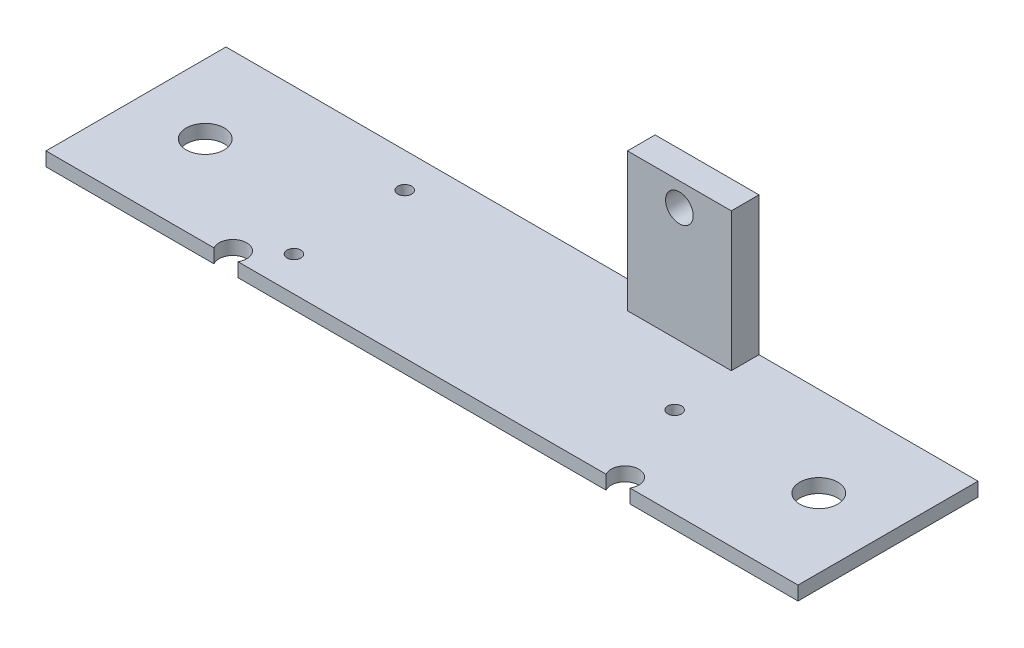
ISO-10303-21;
HEADER;
FILE_DESCRIPTION(('STEP AP214'),'2;1');
FILE_NAME('part.step','',(''),(''),'','','');
FILE_SCHEMA(('AUTOMOTIVE_DESIGN { 1 0 10303 214 1 1 1 1 }'));
ENDSEC;
DATA;
#1=APPLICATION_CONTEXT('core data for automotive mechanical design processes');
#2=APPLICATION_PROTOCOL_DEFINITION('international standard','automotive_design',2000,#1);
#3=PRODUCT_CONTEXT('',#1,'mechanical');
#4=PRODUCT('Part','Part','',(#3));
#5=PRODUCT_RELATED_PRODUCT_CATEGORY('part','',(#4));
#6=PRODUCT_DEFINITION_FORMATION('','',#4);
#7=PRODUCT_DEFINITION_CONTEXT('part definition',#1,'design');
#8=PRODUCT_DEFINITION('design','',#6,#7);
#9=PRODUCT_DEFINITION_SHAPE('','',#8);
#10=(LENGTH_UNIT() NAMED_UNIT(*) SI_UNIT(.MILLI.,.METRE.));
#11=(NAMED_UNIT(*) PLANE_ANGLE_UNIT() SI_UNIT($,.RADIAN.));
#12=(NAMED_UNIT(*) SI_UNIT($,.STERADIAN.) SOLID_ANGLE_UNIT());
#13=UNCERTAINTY_MEASURE_WITH_UNIT(LENGTH_MEASURE(1.E-05),#10,'distance_accuracy_value','');
#14=(GEOMETRIC_REPRESENTATION_CONTEXT(3) GLOBAL_UNCERTAINTY_ASSIGNED_CONTEXT((#13)) GLOBAL_UNIT_ASSIGNED_CONTEXT((#10,
#11,#12)) REPRESENTATION_CONTEXT('',''));
#15=CARTESIAN_POINT('',(0.,0.,0.));
#16=DIRECTION('',(0.,0.,1.));
#17=DIRECTION('',(1.,0.,0.));
#18=AXIS2_PLACEMENT_3D('',#15,#16,#17);
#19=CARTESIAN_POINT('',(-82.64,2.,25.));
#20=DIRECTION('',(0.,-1.,0.));
#21=DIRECTION('',(0.,0.,-1.));
#22=AXIS2_PLACEMENT_3D('',#19,#20,#21);
#23=CYLINDRICAL_SURFACE('',#22,2.);
#24=CARTESIAN_POINT('',(-82.64,0.,25.));
#25=DIRECTION('',(0.,1.,0.));
#26=DIRECTION('',(0.,0.,1.));
#27=AXIS2_PLACEMENT_3D('',#24,#25,#26);
#28=CIRCLE('',#27,2.);
#29=CARTESIAN_POINT('',(-80.9079491924311,0.,26.));
#30=VERTEX_POINT('',#29);
#31=CARTESIAN_POINT('',(-84.3720508075689,0.,26.));
#32=VERTEX_POINT('',#31);
#33=EDGE_CURVE('E202',#30,#32,#28,.T.);
#34=ORIENTED_EDGE('',*,*,#33,.F.);
#35=DIRECTION('',(0.,-1.,0.));
#36=VECTOR('',#35,1.);
#37=CARTESIAN_POINT('',(-80.9079491924311,2.,26.));
#38=LINE('',#37,#36);
#39=CARTESIAN_POINT('',(-80.9079491924311,2.,26.));
#40=VERTEX_POINT('',#39);
#41=EDGE_CURVE('E11',#40,#30,#38,.T.);
#42=ORIENTED_EDGE('',*,*,#41,.F.);
#43=CARTESIAN_POINT('',(-82.64,2.,25.));
#44=DIRECTION('',(0.,1.,0.));
#45=DIRECTION('',(0.,0.,1.));
#46=AXIS2_PLACEMENT_3D('',#43,#44,#45);
#47=CIRCLE('',#46,2.);
#48=CARTESIAN_POINT('',(-84.3720508075689,2.,26.));
#49=VERTEX_POINT('',#48);
#50=EDGE_CURVE('E171',#40,#49,#47,.T.);
#51=ORIENTED_EDGE('',*,*,#50,.T.);
#52=DIRECTION('',(0.,-1.,0.));
#53=VECTOR('',#52,1.);
#54=CARTESIAN_POINT('',(-84.3720508075689,2.,26.));
#55=LINE('',#54,#53);
#56=EDGE_CURVE('E195',#49,#32,#55,.T.);
#57=ORIENTED_EDGE('',*,*,#56,.T.);
#58=EDGE_LOOP('',(#34,#42,#51,#57));
#59=FACE_BOUND('',#58,.T.);
#60=ADVANCED_FACE('F41',(#59),#23,.F.);
#61=CARTESIAN_POINT('',(0.,2.,26.));
#62=DIRECTION('',(0.,0.,1.));
#63=DIRECTION('',(1.,0.,0.));
#64=AXIS2_PLACEMENT_3D('',#61,#62,#63);
#65=PLANE('',#64);
#66=DIRECTION('',(-1.,0.,0.));
#67=VECTOR('',#66,1.);
#68=CARTESIAN_POINT('',(0.,0.,26.));
#69=LINE('',#68,#67);
#70=CARTESIAN_POINT('',(-27.7320508075689,0.,26.));
#71=VERTEX_POINT('',#70);
#72=EDGE_CURVE('E205',#71,#30,#69,.T.);
#73=ORIENTED_EDGE('',*,*,#72,.F.);
#74=DIRECTION('',(0.,-1.,0.));
#75=VECTOR('',#74,1.);
#76=CARTESIAN_POINT('',(-27.7320508075689,2.,26.));
#77=LINE('',#76,#75);
#78=CARTESIAN_POINT('',(-27.7320508075689,2.,26.));
#79=VERTEX_POINT('',#78);
#80=EDGE_CURVE('E49',#79,#71,#77,.T.);
#81=ORIENTED_EDGE('',*,*,#80,.F.);
#82=DIRECTION('',(-1.,0.,0.));
#83=VECTOR('',#82,1.);
#84=CARTESIAN_POINT('',(0.,2.,26.));
#85=LINE('',#84,#83);
#86=EDGE_CURVE('E174',#79,#40,#85,.T.);
#87=ORIENTED_EDGE('',*,*,#86,.T.);
#88=ORIENTED_EDGE('',*,*,#41,.T.);
#89=EDGE_LOOP('',(#73,#81,#87,#88));
#90=FACE_BOUND('',#89,.T.);
#91=ADVANCED_FACE('F245',(#90),#65,.T.);
#92=CARTESIAN_POINT('',(-26.,2.,25.));
#93=DIRECTION('',(0.,-1.,0.));
#94=DIRECTION('',(0.,0.,-1.));
#95=AXIS2_PLACEMENT_3D('',#92,#93,#94);
#96=CYLINDRICAL_SURFACE('',#95,2.);
#97=CARTESIAN_POINT('',(-26.,0.,25.));
#98=DIRECTION('',(0.,1.,0.));
#99=DIRECTION('',(0.,0.,1.));
#100=AXIS2_PLACEMENT_3D('',#97,#98,#99);
#101=CIRCLE('',#100,2.);
#102=CARTESIAN_POINT('',(-24.2679491924311,0.,26.));
#103=VERTEX_POINT('',#102);
#104=EDGE_CURVE('E208',#103,#71,#101,.T.);
#105=ORIENTED_EDGE('',*,*,#104,.F.);
#106=DIRECTION('',(0.,-1.,0.));
#107=VECTOR('',#106,1.);
#108=CARTESIAN_POINT('',(-24.2679491924311,2.,26.));
#109=LINE('',#108,#107);
#110=CARTESIAN_POINT('',(-24.2679491924311,2.,26.));
#111=VERTEX_POINT('',#110);
#112=EDGE_CURVE('E236',#111,#103,#109,.T.);
#113=ORIENTED_EDGE('',*,*,#112,.F.);
#114=CARTESIAN_POINT('',(-26.,2.,25.));
#115=DIRECTION('',(0.,1.,0.));
#116=DIRECTION('',(0.,0.,1.));
#117=AXIS2_PLACEMENT_3D('',#114,#115,#116);
#118=CIRCLE('',#117,2.);
#119=EDGE_CURVE('E177',#111,#79,#118,.T.);
#120=ORIENTED_EDGE('',*,*,#119,.T.);
#121=ORIENTED_EDGE('',*,*,#80,.T.);
#122=EDGE_LOOP('',(#105,#113,#120,#121));
#123=FACE_BOUND('',#122,.T.);
#124=ADVANCED_FACE('F240',(#123),#96,.F.);
#125=CARTESIAN_POINT('',(0.,0.,26.));
#126=VERTEX_POINT('',#125);
#127=EDGE_CURVE('E210',#126,#103,#69,.T.);
#128=ORIENTED_EDGE('',*,*,#127,.F.);
#129=DIRECTION('',(0.,-1.,0.));
#130=VECTOR('',#129,1.);
#131=CARTESIAN_POINT('',(0.,2.,26.));
#132=LINE('',#131,#130);
#133=CARTESIAN_POINT('',(0.,2.,26.));
#134=VERTEX_POINT('',#133);
#135=EDGE_CURVE('E234',#134,#126,#132,.T.);
#136=ORIENTED_EDGE('',*,*,#135,.F.);
#137=EDGE_CURVE('E179',#134,#111,#85,.T.);
#138=ORIENTED_EDGE('',*,*,#137,.T.);
#139=ORIENTED_EDGE('',*,*,#112,.T.);
#140=EDGE_LOOP('',(#128,#136,#138,#139));
#141=FACE_BOUND('',#140,.T.);
#142=ADVANCED_FACE('F270',(#141),#65,.T.);
#143=CARTESIAN_POINT('',(0.,2.,0.));
#144=DIRECTION('',(1.,0.,0.));
#145=DIRECTION('',(0.,0.,-1.));
#146=AXIS2_PLACEMENT_3D('',#143,#144,#145);
#147=PLANE('',#146);
#148=DIRECTION('',(0.,0.,1.));
#149=VECTOR('',#148,1.);
#150=CARTESIAN_POINT('',(0.,0.,0.));
#151=LINE('',#150,#149);
#152=CARTESIAN_POINT('',(0.,0.,0.));
#153=VERTEX_POINT('',#152);
#154=EDGE_CURVE('E213',#153,#126,#151,.T.);
#155=ORIENTED_EDGE('',*,*,#154,.F.);
#156=DIRECTION('',(0.,-1.,0.));
#157=VECTOR('',#156,1.);
#158=CARTESIAN_POINT('',(0.,2.,0.));
#159=LINE('',#158,#157);
#160=CARTESIAN_POINT('',(0.,2.,0.));
#161=VERTEX_POINT('',#160);
#162=EDGE_CURVE('E232',#161,#153,#159,.T.);
#163=ORIENTED_EDGE('',*,*,#162,.F.);
#164=DIRECTION('',(0.,0.,1.));
#165=VECTOR('',#164,1.);
#166=CARTESIAN_POINT('',(0.,2.,0.));
#167=LINE('',#166,#165);
#168=EDGE_CURVE('E182',#161,#134,#167,.T.);
#169=ORIENTED_EDGE('',*,*,#168,.T.);
#170=ORIENTED_EDGE('',*,*,#135,.T.);
#171=EDGE_LOOP('',(#155,#163,#169,#170));
#172=FACE_BOUND('',#171,.T.);
#173=ADVANCED_FACE('F266',(#172),#147,.T.);
#174=CARTESIAN_POINT('',(0.,2.,0.));
#175=DIRECTION('',(0.,0.,1.));
#176=DIRECTION('',(1.,0.,0.));
#177=AXIS2_PLACEMENT_3D('',#174,#175,#176);
#178=PLANE('',#177);
#179=CARTESIAN_POINT('',(-39.1383641892585,18.6227285915926,0.));
#180=DIRECTION('',(0.,0.,1.));
#181=DIRECTION('',(1.,0.,0.));
#182=AXIS2_PLACEMENT_3D('',#179,#180,#181);
#183=CIRCLE('',#182,2.);
#184=CARTESIAN_POINT('',(-37.1383641892585,18.6227285915926,0.));
#185=VERTEX_POINT('',#184);
#186=EDGE_CURVE('E461',#185,#185,#183,.T.);
#187=ORIENTED_EDGE('',*,*,#186,.T.);
#188=EDGE_LOOP('',(#187));
#189=FACE_BOUND('',#188,.T.);
#190=DIRECTION('',(-1.,0.,0.));
#191=VECTOR('',#190,1.);
#192=CARTESIAN_POINT('',(0.,0.,0.));
#193=LINE('',#192,#191);
#194=CARTESIAN_POINT('',(-108.64,0.,0.));
#195=VERTEX_POINT('',#194);
#196=EDGE_CURVE('E216',#153,#195,#193,.T.);
#197=ORIENTED_EDGE('',*,*,#196,.T.);
#198=DIRECTION('',(0.,-1.,0.));
#199=VECTOR('',#198,1.);
#200=CARTESIAN_POINT('',(-108.64,2.,0.));
#201=LINE('',#200,#199);
#202=CARTESIAN_POINT('',(-108.64,2.,0.));
#203=VERTEX_POINT('',#202);
#204=EDGE_CURVE('E229',#203,#195,#201,.T.);
#205=ORIENTED_EDGE('',*,*,#204,.F.);
#206=DIRECTION('',(-1.,0.,0.));
#207=VECTOR('',#206,1.);
#208=CARTESIAN_POINT('',(0.,2.,0.));
#209=LINE('',#208,#207);
#210=CARTESIAN_POINT('',(-46.6383641892585,2.,0.));
#211=VERTEX_POINT('',#210);
#212=EDGE_CURVE('E185',#211,#203,#209,.T.);
#213=ORIENTED_EDGE('',*,*,#212,.F.);
#214=DIRECTION('',(0.,-1.,0.));
#215=VECTOR('',#214,1.);
#216=CARTESIAN_POINT('',(-46.6383641892585,22.,0.));
#217=LINE('',#216,#215);
#218=CARTESIAN_POINT('',(-46.6383641892585,22.,0.));
#219=VERTEX_POINT('',#218);
#220=EDGE_CURVE('E136',#219,#211,#217,.T.);
#221=ORIENTED_EDGE('',*,*,#220,.F.);
#222=DIRECTION('',(-1.,0.,0.));
#223=VECTOR('',#222,1.);
#224=CARTESIAN_POINT('',(-31.6383641892585,22.,0.));
#225=LINE('',#224,#223);
#226=CARTESIAN_POINT('',(-31.6383641892585,22.,0.));
#227=VERTEX_POINT('',#226);
#228=EDGE_CURVE('E128',#227,#219,#225,.T.);
#229=ORIENTED_EDGE('',*,*,#228,.F.);
#230=DIRECTION('',(0.,-1.,0.));
#231=VECTOR('',#230,1.);
#232=CARTESIAN_POINT('',(-31.6383641892585,22.,0.));
#233=LINE('',#232,#231);
#234=CARTESIAN_POINT('',(-31.6383641892585,2.,0.));
#235=VERTEX_POINT('',#234);
#236=EDGE_CURVE('E134',#227,#235,#233,.T.);
#237=ORIENTED_EDGE('',*,*,#236,.T.);
#238=EDGE_CURVE('E186',#161,#235,#209,.T.);
#239=ORIENTED_EDGE('',*,*,#238,.F.);
#240=ORIENTED_EDGE('',*,*,#162,.T.);
#241=EDGE_LOOP('',(#197,#205,#213,#221,#229,#237,#239,#240));
#242=FACE_BOUND('',#241,.T.);
#243=ADVANCED_FACE('F131',(#189,#242),#178,.F.);
#244=CARTESIAN_POINT('',(-108.64,2.,0.));
#245=DIRECTION('',(1.,0.,0.));
#246=DIRECTION('',(0.,0.,-1.));
#247=AXIS2_PLACEMENT_3D('',#244,#245,#246);
#248=PLANE('',#247);
#249=DIRECTION('',(0.,0.,1.));
#250=VECTOR('',#249,1.);
#251=CARTESIAN_POINT('',(-108.64,0.,0.));
#252=LINE('',#251,#250);
#253=CARTESIAN_POINT('',(-108.64,0.,26.));
#254=VERTEX_POINT('',#253);
#255=EDGE_CURVE('E218',#195,#254,#252,.T.);
#256=ORIENTED_EDGE('',*,*,#255,.T.);
#257=DIRECTION('',(0.,-1.,0.));
#258=VECTOR('',#257,1.);
#259=CARTESIAN_POINT('',(-108.64,2.,26.));
#260=LINE('',#259,#258);
#261=CARTESIAN_POINT('',(-108.64,2.,26.));
#262=VERTEX_POINT('',#261);
#263=EDGE_CURVE('E227',#262,#254,#260,.T.);
#264=ORIENTED_EDGE('',*,*,#263,.F.);
#265=DIRECTION('',(0.,0.,1.));
#266=VECTOR('',#265,1.);
#267=CARTESIAN_POINT('',(-108.64,2.,0.));
#268=LINE('',#267,#266);
#269=EDGE_CURVE('E188',#203,#262,#268,.T.);
#270=ORIENTED_EDGE('',*,*,#269,.F.);
#271=ORIENTED_EDGE('',*,*,#204,.T.);
#272=EDGE_LOOP('',(#256,#264,#270,#271));
#273=FACE_BOUND('',#272,.T.);
#274=ADVANCED_FACE('F263',(#273),#248,.F.);
#275=CARTESIAN_POINT('',(-10.,2.,13.));
#276=DIRECTION('',(0.,-1.,0.));
#277=DIRECTION('',(0.,0.,-1.));
#278=AXIS2_PLACEMENT_3D('',#275,#276,#277);
#279=CYLINDRICAL_SURFACE('',#278,2.75);
#280=CARTESIAN_POINT('',(-10.,2.,13.));
#281=DIRECTION('',(0.,1.,0.));
#282=DIRECTION('',(0.,0.,1.));
#283=AXIS2_PLACEMENT_3D('',#280,#281,#282);
#284=CIRCLE('',#283,2.75);
#285=CARTESIAN_POINT('',(-10.,2.,15.75));
#286=VERTEX_POINT('',#285);
#287=EDGE_CURVE('E190',#286,#286,#284,.T.);
#288=ORIENTED_EDGE('',*,*,#287,.T.);
#289=EDGE_LOOP('',(#288));
#290=FACE_BOUND('',#289,.T.);
#291=CARTESIAN_POINT('',(-10.,0.,13.));
#292=DIRECTION('',(0.,1.,0.));
#293=DIRECTION('',(0.,0.,1.));
#294=AXIS2_PLACEMENT_3D('',#291,#292,#293);
#295=CIRCLE('',#294,2.75);
#296=CARTESIAN_POINT('',(-10.,0.,15.75));
#297=VERTEX_POINT('',#296);
#298=EDGE_CURVE('E221',#297,#297,#295,.T.);
#299=ORIENTED_EDGE('',*,*,#298,.F.);
#300=EDGE_LOOP('',(#299));
#301=FACE_BOUND('',#300,.T.);
#302=ADVANCED_FACE('F316',(#290,#301),#279,.F.);
#303=EDGE_CURVE('E209',#32,#254,#69,.T.);
#304=ORIENTED_EDGE('',*,*,#303,.F.);
#305=ORIENTED_EDGE('',*,*,#56,.F.);
#306=EDGE_CURVE('E178',#49,#262,#85,.T.);
#307=ORIENTED_EDGE('',*,*,#306,.T.);
#308=ORIENTED_EDGE('',*,*,#263,.T.);
#309=EDGE_LOOP('',(#304,#305,#307,#308));
#310=FACE_BOUND('',#309,.T.);
#311=ADVANCED_FACE('F257',(#310),#65,.T.);
#312=CARTESIAN_POINT('',(-30.82,2.,13.));
#313=DIRECTION('',(0.,-1.,0.));
#314=DIRECTION('',(0.,0.,-1.));
#315=AXIS2_PLACEMENT_3D('',#312,#313,#314);
#316=CYLINDRICAL_SURFACE('',#315,1.);
#317=CARTESIAN_POINT('',(-30.82,2.,13.));
#318=DIRECTION('',(0.,1.,0.));
#319=DIRECTION('',(0.,0.,1.));
#320=AXIS2_PLACEMENT_3D('',#317,#318,#319);
#321=CIRCLE('',#320,1.);
#322=CARTESIAN_POINT('',(-30.82,2.,14.));
#323=VERTEX_POINT('',#322);
#324=EDGE_CURVE('E168',#323,#323,#321,.T.);
#325=ORIENTED_EDGE('',*,*,#324,.T.);
#326=EDGE_LOOP('',(#325));
#327=FACE_BOUND('',#326,.T.);
#328=CARTESIAN_POINT('',(-30.82,0.,13.));
#329=DIRECTION('',(0.,1.,0.));
#330=DIRECTION('',(0.,0.,1.));
#331=AXIS2_PLACEMENT_3D('',#328,#329,#330);
#332=CIRCLE('',#331,1.);
#333=CARTESIAN_POINT('',(-30.82,0.,14.));
#334=VERTEX_POINT('',#333);
#335=EDGE_CURVE('E199',#334,#334,#332,.T.);
#336=ORIENTED_EDGE('',*,*,#335,.F.);
#337=EDGE_LOOP('',(#336));
#338=FACE_BOUND('',#337,.T.);
#339=ADVANCED_FACE('F284',(#327,#338),#316,.F.);
#340=CARTESIAN_POINT('',(-77.82,2.,21.));
#341=DIRECTION('',(0.,-1.,0.));
#342=DIRECTION('',(0.,0.,-1.));
#343=AXIS2_PLACEMENT_3D('',#340,#341,#342);
#344=CYLINDRICAL_SURFACE('',#343,0.999999999999998);
#345=CARTESIAN_POINT('',(-77.82,2.,21.));
#346=DIRECTION('',(0.,1.,0.));
#347=DIRECTION('',(0.,0.,1.));
#348=AXIS2_PLACEMENT_3D('',#345,#346,#347);
#349=CIRCLE('',#348,0.999999999999998);
#350=CARTESIAN_POINT('',(-77.82,2.,22.));
#351=VERTEX_POINT('',#350);
#352=EDGE_CURVE('E164',#351,#351,#349,.T.);
#353=ORIENTED_EDGE('',*,*,#352,.T.);
#354=EDGE_LOOP('',(#353));
#355=FACE_BOUND('',#354,.T.);
#356=CARTESIAN_POINT('',(-77.82,0.,21.));
#357=DIRECTION('',(0.,1.,0.));
#358=DIRECTION('',(0.,0.,1.));
#359=AXIS2_PLACEMENT_3D('',#356,#357,#358);
#360=CIRCLE('',#359,0.999999999999998);
#361=CARTESIAN_POINT('',(-77.82,0.,22.));
#362=VERTEX_POINT('',#361);
#363=EDGE_CURVE('E155',#362,#362,#360,.T.);
#364=ORIENTED_EDGE('',*,*,#363,.F.);
#365=EDGE_LOOP('',(#364));
#366=FACE_BOUND('',#365,.T.);
#367=ADVANCED_FACE('F286',(#355,#366),#344,.F.);
#368=CARTESIAN_POINT('',(-77.82,2.,5.));
#369=DIRECTION('',(0.,-1.,0.));
#370=DIRECTION('',(0.,0.,-1.));
#371=AXIS2_PLACEMENT_3D('',#368,#369,#370);
#372=CYLINDRICAL_SURFACE('',#371,0.999999999999998);
#373=CARTESIAN_POINT('',(-77.82,2.,5.));
#374=DIRECTION('',(0.,1.,0.));
#375=DIRECTION('',(0.,0.,1.));
#376=AXIS2_PLACEMENT_3D('',#373,#374,#375);
#377=CIRCLE('',#376,0.999999999999998);
#378=CARTESIAN_POINT('',(-77.82,2.,6.));
#379=VERTEX_POINT('',#378);
#380=EDGE_CURVE('E161',#379,#379,#377,.T.);
#381=ORIENTED_EDGE('',*,*,#380,.T.);
#382=EDGE_LOOP('',(#381));
#383=FACE_BOUND('',#382,.T.);
#384=CARTESIAN_POINT('',(-77.82,0.,5.));
#385=DIRECTION('',(0.,1.,0.));
#386=DIRECTION('',(0.,0.,1.));
#387=AXIS2_PLACEMENT_3D('',#384,#385,#386);
#388=CIRCLE('',#387,0.999999999999998);
#389=CARTESIAN_POINT('',(-77.82,0.,6.));
#390=VERTEX_POINT('',#389);
#391=EDGE_CURVE('E152',#390,#390,#388,.T.);
#392=ORIENTED_EDGE('',*,*,#391,.F.);
#393=EDGE_LOOP('',(#392));
#394=FACE_BOUND('',#393,.T.);
#395=ADVANCED_FACE('F43',(#383,#394),#372,.F.);
#396=CARTESIAN_POINT('',(-98.64,2.,13.));
#397=DIRECTION('',(0.,-1.,0.));
#398=DIRECTION('',(0.,0.,-1.));
#399=AXIS2_PLACEMENT_3D('',#396,#397,#398);
#400=CYLINDRICAL_SURFACE('',#399,2.75000000000001);
#401=CARTESIAN_POINT('',(-98.64,2.,13.));
#402=DIRECTION('',(0.,1.,0.));
#403=DIRECTION('',(0.,0.,1.));
#404=AXIS2_PLACEMENT_3D('',#401,#402,#403);
#405=CIRCLE('',#404,2.75000000000001);
#406=CARTESIAN_POINT('',(-98.64,2.,15.75));
#407=VERTEX_POINT('',#406);
#408=EDGE_CURVE('E193',#407,#407,#405,.T.);
#409=ORIENTED_EDGE('',*,*,#408,.T.);
#410=EDGE_LOOP('',(#409));
#411=FACE_BOUND('',#410,.T.);
#412=CARTESIAN_POINT('',(-98.64,0.,13.));
#413=DIRECTION('',(0.,1.,0.));
#414=DIRECTION('',(0.,0.,1.));
#415=AXIS2_PLACEMENT_3D('',#412,#413,#414);
#416=CIRCLE('',#415,2.75000000000001);
#417=CARTESIAN_POINT('',(-98.64,0.,15.75));
#418=VERTEX_POINT('',#417);
#419=EDGE_CURVE('E165',#418,#418,#416,.T.);
#420=ORIENTED_EDGE('',*,*,#419,.F.);
#421=EDGE_LOOP('',(#420));
#422=FACE_BOUND('',#421,.T.);
#423=ADVANCED_FACE('F293',(#411,#422),#400,.F.);
#424=CARTESIAN_POINT('',(0.,2.,0.));
#425=DIRECTION('',(0.,1.,0.));
#426=DIRECTION('',(0.,0.,1.));
#427=AXIS2_PLACEMENT_3D('',#424,#425,#426);
#428=PLANE('',#427);
#429=DIRECTION('',(0.,0.,-1.));
#430=VECTOR('',#429,1.);
#431=CARTESIAN_POINT('',(-31.6383641892585,2.,0.));
#432=LINE('',#431,#430);
#433=CARTESIAN_POINT('',(-31.6383641892585,2.,4.));
#434=VERTEX_POINT('',#433);
#435=EDGE_CURVE('E56',#434,#235,#432,.T.);
#436=ORIENTED_EDGE('',*,*,#435,.F.);
#437=DIRECTION('',(1.,0.,0.));
#438=VECTOR('',#437,1.);
#439=CARTESIAN_POINT('',(-31.6383641892585,2.,4.));
#440=LINE('',#439,#438);
#441=CARTESIAN_POINT('',(-46.6383641892585,2.,4.));
#442=VERTEX_POINT('',#441);
#443=EDGE_CURVE('E149',#442,#434,#440,.T.);
#444=ORIENTED_EDGE('',*,*,#443,.F.);
#445=DIRECTION('',(0.,0.,1.));
#446=VECTOR('',#445,1.);
#447=CARTESIAN_POINT('',(-46.6383641892585,2.,0.));
#448=LINE('',#447,#446);
#449=EDGE_CURVE('E62',#211,#442,#448,.T.);
#450=ORIENTED_EDGE('',*,*,#449,.F.);
#451=ORIENTED_EDGE('',*,*,#212,.T.);
#452=ORIENTED_EDGE('',*,*,#269,.T.);
#453=ORIENTED_EDGE('',*,*,#306,.F.);
#454=ORIENTED_EDGE('',*,*,#50,.F.);
#455=ORIENTED_EDGE('',*,*,#86,.F.);
#456=ORIENTED_EDGE('',*,*,#119,.F.);
#457=ORIENTED_EDGE('',*,*,#137,.F.);
#458=ORIENTED_EDGE('',*,*,#168,.F.);
#459=ORIENTED_EDGE('',*,*,#238,.T.);
#460=EDGE_LOOP('',(#436,#444,#450,#451,#452,#453,#454,#455,#456,#457,#458,#459));
#461=FACE_BOUND('',#460,.T.);
#462=ORIENTED_EDGE('',*,*,#380,.F.);
#463=EDGE_LOOP('',(#462));
#464=FACE_BOUND('',#463,.T.);
#465=ORIENTED_EDGE('',*,*,#352,.F.);
#466=EDGE_LOOP('',(#465));
#467=FACE_BOUND('',#466,.T.);
#468=ORIENTED_EDGE('',*,*,#324,.F.);
#469=EDGE_LOOP('',(#468));
#470=FACE_BOUND('',#469,.T.);
#471=ORIENTED_EDGE('',*,*,#287,.F.);
#472=EDGE_LOOP('',(#471));
#473=FACE_BOUND('',#472,.T.);
#474=ORIENTED_EDGE('',*,*,#408,.F.);
#475=EDGE_LOOP('',(#474));
#476=FACE_BOUND('',#475,.T.);
#477=ADVANCED_FACE('F271',(#461,#464,#467,#470,#473,#476),#428,.T.);
#478=CARTESIAN_POINT('',(0.,0.,0.));
#479=DIRECTION('',(0.,1.,0.));
#480=DIRECTION('',(0.,0.,1.));
#481=AXIS2_PLACEMENT_3D('',#478,#479,#480);
#482=PLANE('',#481);
#483=ORIENTED_EDGE('',*,*,#391,.T.);
#484=EDGE_LOOP('',(#483));
#485=FACE_BOUND('',#484,.T.);
#486=ORIENTED_EDGE('',*,*,#363,.T.);
#487=EDGE_LOOP('',(#486));
#488=FACE_BOUND('',#487,.T.);
#489=ORIENTED_EDGE('',*,*,#335,.T.);
#490=EDGE_LOOP('',(#489));
#491=FACE_BOUND('',#490,.T.);
#492=ORIENTED_EDGE('',*,*,#33,.T.);
#493=ORIENTED_EDGE('',*,*,#303,.T.);
#494=ORIENTED_EDGE('',*,*,#255,.F.);
#495=ORIENTED_EDGE('',*,*,#196,.F.);
#496=ORIENTED_EDGE('',*,*,#154,.T.);
#497=ORIENTED_EDGE('',*,*,#127,.T.);
#498=ORIENTED_EDGE('',*,*,#104,.T.);
#499=ORIENTED_EDGE('',*,*,#72,.T.);
#500=EDGE_LOOP('',(#492,#493,#494,#495,#496,#497,#498,#499));
#501=FACE_BOUND('',#500,.T.);
#502=ORIENTED_EDGE('',*,*,#298,.T.);
#503=EDGE_LOOP('',(#502));
#504=FACE_BOUND('',#503,.T.);
#505=ORIENTED_EDGE('',*,*,#419,.T.);
#506=EDGE_LOOP('',(#505));
#507=FACE_BOUND('',#506,.T.);
#508=ADVANCED_FACE('F248',(#485,#488,#491,#501,#504,#507),#482,.F.);
#509=CARTESIAN_POINT('',(-31.6383641892585,22.,0.));
#510=DIRECTION('',(-1.,0.,0.));
#511=DIRECTION('',(0.,0.,1.));
#512=AXIS2_PLACEMENT_3D('',#509,#510,#511);
#513=PLANE('',#512);
#514=ORIENTED_EDGE('',*,*,#435,.T.);
#515=ORIENTED_EDGE('',*,*,#236,.F.);
#516=DIRECTION('',(0.,0.,-1.));
#517=VECTOR('',#516,1.);
#518=CARTESIAN_POINT('',(-31.6383641892585,22.,0.));
#519=LINE('',#518,#517);
#520=CARTESIAN_POINT('',(-31.6383641892585,22.,4.));
#521=VERTEX_POINT('',#520);
#522=EDGE_CURVE('E140',#521,#227,#519,.T.);
#523=ORIENTED_EDGE('',*,*,#522,.F.);
#524=DIRECTION('',(0.,-1.,0.));
#525=VECTOR('',#524,1.);
#526=CARTESIAN_POINT('',(-31.6383641892585,22.,4.));
#527=LINE('',#526,#525);
#528=EDGE_CURVE('E467',#521,#434,#527,.T.);
#529=ORIENTED_EDGE('',*,*,#528,.T.);
#530=EDGE_LOOP('',(#514,#515,#523,#529));
#531=FACE_BOUND('',#530,.T.);
#532=ADVANCED_FACE('F151',(#531),#513,.F.);
#533=CARTESIAN_POINT('',(-46.6383641892585,22.,0.));
#534=DIRECTION('',(1.,0.,0.));
#535=DIRECTION('',(0.,0.,-1.));
#536=AXIS2_PLACEMENT_3D('',#533,#534,#535);
#537=PLANE('',#536);
#538=ORIENTED_EDGE('',*,*,#449,.T.);
#539=DIRECTION('',(0.,-1.,0.));
#540=VECTOR('',#539,1.);
#541=CARTESIAN_POINT('',(-46.6383641892585,22.,4.));
#542=LINE('',#541,#540);
#543=CARTESIAN_POINT('',(-46.6383641892585,22.,4.));
#544=VERTEX_POINT('',#543);
#545=EDGE_CURVE('E157',#544,#442,#542,.T.);
#546=ORIENTED_EDGE('',*,*,#545,.F.);
#547=DIRECTION('',(0.,0.,1.));
#548=VECTOR('',#547,1.);
#549=CARTESIAN_POINT('',(-46.6383641892585,22.,0.));
#550=LINE('',#549,#548);
#551=EDGE_CURVE('E139',#219,#544,#550,.T.);
#552=ORIENTED_EDGE('',*,*,#551,.F.);
#553=ORIENTED_EDGE('',*,*,#220,.T.);
#554=EDGE_LOOP('',(#538,#546,#552,#553));
#555=FACE_BOUND('',#554,.T.);
#556=ADVANCED_FACE('F310',(#555),#537,.F.);
#557=CARTESIAN_POINT('',(-31.6383641892585,22.,4.));
#558=DIRECTION('',(0.,0.,-1.));
#559=DIRECTION('',(-1.,0.,0.));
#560=AXIS2_PLACEMENT_3D('',#557,#558,#559);
#561=PLANE('',#560);
#562=CARTESIAN_POINT('',(-39.1383641892585,18.6227285915926,4.));
#563=DIRECTION('',(0.,0.,1.));
#564=DIRECTION('',(1.,0.,0.));
#565=AXIS2_PLACEMENT_3D('',#562,#563,#564);
#566=CIRCLE('',#565,2.);
#567=CARTESIAN_POINT('',(-37.1383641892585,18.6227285915926,4.));
#568=VERTEX_POINT('',#567);
#569=EDGE_CURVE('E458',#568,#568,#566,.T.);
#570=ORIENTED_EDGE('',*,*,#569,.F.);
#571=EDGE_LOOP('',(#570));
#572=FACE_BOUND('',#571,.T.);
#573=ORIENTED_EDGE('',*,*,#443,.T.);
#574=ORIENTED_EDGE('',*,*,#528,.F.);
#575=DIRECTION('',(1.,0.,0.));
#576=VECTOR('',#575,1.);
#577=CARTESIAN_POINT('',(-31.6383641892585,22.,4.));
#578=LINE('',#577,#576);
#579=EDGE_CURVE('E145',#544,#521,#578,.T.);
#580=ORIENTED_EDGE('',*,*,#579,.F.);
#581=ORIENTED_EDGE('',*,*,#545,.T.);
#582=EDGE_LOOP('',(#573,#574,#580,#581));
#583=FACE_BOUND('',#582,.T.);
#584=ADVANCED_FACE('F416',(#572,#583),#561,.F.);
#585=CARTESIAN_POINT('',(0.,22.,0.));
#586=DIRECTION('',(0.,-1.,0.));
#587=DIRECTION('',(0.,0.,-1.));
#588=AXIS2_PLACEMENT_3D('',#585,#586,#587);
#589=PLANE('',#588);
#590=ORIENTED_EDGE('',*,*,#522,.T.);
#591=ORIENTED_EDGE('',*,*,#228,.T.);
#592=ORIENTED_EDGE('',*,*,#551,.T.);
#593=ORIENTED_EDGE('',*,*,#579,.T.);
#594=EDGE_LOOP('',(#590,#591,#592,#593));
#595=FACE_BOUND('',#594,.T.);
#596=ADVANCED_FACE('F143',(#595),#589,.F.);
#597=CARTESIAN_POINT('',(-39.1383641892585,18.6227285915926,-16.));
#598=DIRECTION('',(0.,0.,1.));
#599=DIRECTION('',(1.,0.,0.));
#600=AXIS2_PLACEMENT_3D('',#597,#598,#599);
#601=CYLINDRICAL_SURFACE('',#600,2.);
#602=ORIENTED_EDGE('',*,*,#569,.T.);
#603=EDGE_LOOP('',(#602));
#604=FACE_BOUND('',#603,.T.);
#605=ORIENTED_EDGE('',*,*,#186,.F.);
#606=EDGE_LOOP('',(#605));
#607=FACE_BOUND('',#606,.T.);
#608=ADVANCED_FACE('F433',(#604,#607),#601,.F.);
#609=CLOSED_SHELL('',(#60,#91,#124,#142,#173,#243,#274,#302,#311,#339,#367,#395,#423,#477,#508,
#532,#556,#584,#596,#608));
#610=MANIFOLD_SOLID_BREP('B2',#609);
#611=ADVANCED_BREP_SHAPE_REPRESENTATION('',(#18,#610),#14);
#612=SHAPE_DEFINITION_REPRESENTATION(#9,#611);
ENDSEC;
END-ISO-10303-21;
